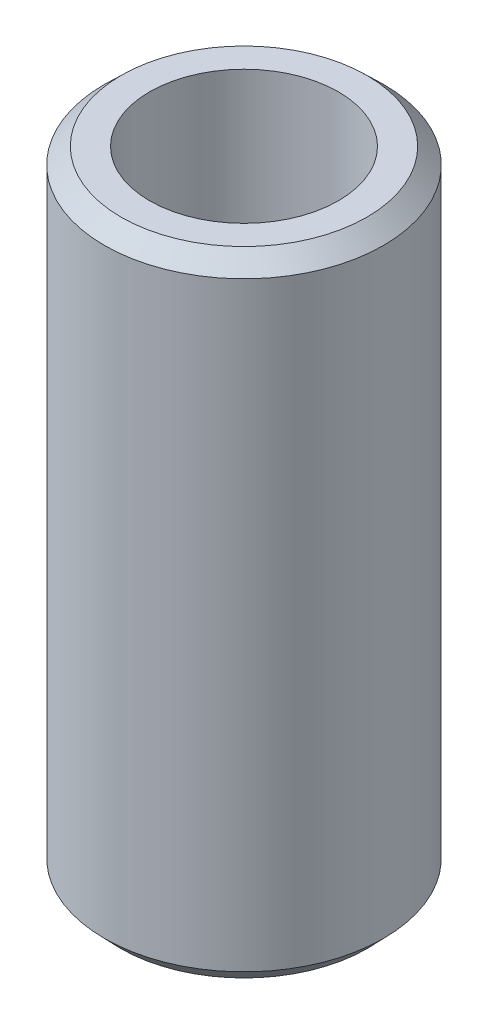
ISO-10303-21;
HEADER;
FILE_DESCRIPTION(('STEP AP214'),'2;1');
FILE_NAME('part.step','',(''),(''),'','','');
FILE_SCHEMA(('AUTOMOTIVE_DESIGN { 1 0 10303 214 1 1 1 1 }'));
ENDSEC;
DATA;
#1=APPLICATION_CONTEXT('core data for automotive mechanical design processes');
#2=APPLICATION_PROTOCOL_DEFINITION('international standard','automotive_design',2000,#1);
#3=PRODUCT_CONTEXT('',#1,'mechanical');
#4=PRODUCT('Part','Part','',(#3));
#5=PRODUCT_RELATED_PRODUCT_CATEGORY('part','',(#4));
#6=PRODUCT_DEFINITION_FORMATION('','',#4);
#7=PRODUCT_DEFINITION_CONTEXT('part definition',#1,'design');
#8=PRODUCT_DEFINITION('design','',#6,#7);
#9=PRODUCT_DEFINITION_SHAPE('','',#8);
#10=(LENGTH_UNIT() NAMED_UNIT(*) SI_UNIT(.MILLI.,.METRE.));
#11=(NAMED_UNIT(*) PLANE_ANGLE_UNIT() SI_UNIT($,.RADIAN.));
#12=(NAMED_UNIT(*) SI_UNIT($,.STERADIAN.) SOLID_ANGLE_UNIT());
#13=UNCERTAINTY_MEASURE_WITH_UNIT(LENGTH_MEASURE(1.E-05),#10,'distance_accuracy_value','');
#14=(GEOMETRIC_REPRESENTATION_CONTEXT(3) GLOBAL_UNCERTAINTY_ASSIGNED_CONTEXT((#13)) GLOBAL_UNIT_ASSIGNED_CONTEXT((#10,
#11,#12)) REPRESENTATION_CONTEXT('',''));
#15=CARTESIAN_POINT('',(0.,0.,0.));
#16=DIRECTION('',(0.,0.,1.));
#17=DIRECTION('',(1.,0.,0.));
#18=AXIS2_PLACEMENT_3D('',#15,#16,#17);
#19=CARTESIAN_POINT('',(0.,102.063704965299,0.));
#20=DIRECTION('',(0.,-1.,0.));
#21=DIRECTION('',(0.,0.,-1.));
#22=AXIS2_PLACEMENT_3D('',#19,#20,#21);
#23=CYLINDRICAL_SURFACE('',#22,22.5);
#24=CARTESIAN_POINT('',(0.,99.4673648616752,0.));
#25=DIRECTION('',(0.,1.,0.));
#26=DIRECTION('',(0.,0.,1.));
#27=AXIS2_PLACEMENT_3D('',#24,#25,#26);
#28=CIRCLE('',#27,22.5);
#29=CARTESIAN_POINT('',(0.,99.4673648616752,22.5));
#30=VERTEX_POINT('',#29);
#31=EDGE_CURVE('E50',#30,#30,#28,.F.);
#32=ORIENTED_EDGE('',*,*,#31,.T.);
#33=EDGE_LOOP('',(#32));
#34=FACE_BOUND('',#33,.T.);
#35=CARTESIAN_POINT('',(0.,2.69394294349172,0.));
#36=DIRECTION('',(0.,1.,0.));
#37=DIRECTION('',(0.,0.,1.));
#38=AXIS2_PLACEMENT_3D('',#35,#36,#37);
#39=CIRCLE('',#38,22.5);
#40=CARTESIAN_POINT('',(0.,2.69394294349172,22.5));
#41=VERTEX_POINT('',#40);
#42=EDGE_CURVE('E51',#41,#41,#39,.T.);
#43=ORIENTED_EDGE('',*,*,#42,.T.);
#44=EDGE_LOOP('',(#43));
#45=FACE_BOUND('',#44,.T.);
#46=ADVANCED_FACE('F39',(#34,#45),#23,.T.);
#47=CARTESIAN_POINT('',(0.,102.063704965299,0.));
#48=DIRECTION('',(0.,1.,0.));
#49=DIRECTION('',(0.,0.,1.));
#50=AXIS2_PLACEMENT_3D('',#47,#48,#49);
#51=PLANE('',#50);
#52=CARTESIAN_POINT('',(0.,102.063704965299,0.));
#53=DIRECTION('',(0.,1.,0.));
#54=DIRECTION('',(0.,0.,1.));
#55=AXIS2_PLACEMENT_3D('',#52,#53,#54);
#56=CIRCLE('',#55,19.8060570565083);
#57=CARTESIAN_POINT('',(0.,102.063704965299,19.8060570565083));
#58=VERTEX_POINT('',#57);
#59=EDGE_CURVE('E54',#58,#58,#56,.T.);
#60=ORIENTED_EDGE('',*,*,#59,.T.);
#61=EDGE_LOOP('',(#60));
#62=FACE_BOUND('',#61,.T.);
#63=CARTESIAN_POINT('',(0.,102.063704965299,0.));
#64=DIRECTION('',(0.,1.,0.));
#65=DIRECTION('',(0.,0.,1.));
#66=AXIS2_PLACEMENT_3D('',#63,#64,#65);
#67=CIRCLE('',#66,15.2227138544082);
#68=CARTESIAN_POINT('',(0.,102.063704965299,15.2227138544082));
#69=VERTEX_POINT('',#68);
#70=EDGE_CURVE('E58',#69,#69,#67,.T.);
#71=ORIENTED_EDGE('',*,*,#70,.F.);
#72=EDGE_LOOP('',(#71));
#73=FACE_BOUND('',#72,.T.);
#74=ADVANCED_FACE('F69',(#62,#73),#51,.T.);
#75=CARTESIAN_POINT('',(0.,0.,0.));
#76=DIRECTION('',(0.,1.,0.));
#77=DIRECTION('',(0.,0.,1.));
#78=AXIS2_PLACEMENT_3D('',#75,#76,#77);
#79=PLANE('',#78);
#80=CARTESIAN_POINT('',(0.,0.,0.));
#81=DIRECTION('',(0.,1.,0.));
#82=DIRECTION('',(0.,0.,1.));
#83=AXIS2_PLACEMENT_3D('',#80,#81,#82);
#84=CIRCLE('',#83,19.9036598963761);
#85=CARTESIAN_POINT('',(0.,0.,19.9036598963761));
#86=VERTEX_POINT('',#85);
#87=EDGE_CURVE('E10',#86,#86,#84,.F.);
#88=ORIENTED_EDGE('',*,*,#87,.T.);
#89=EDGE_LOOP('',(#88));
#90=FACE_BOUND('',#89,.T.);
#91=CARTESIAN_POINT('',(0.,0.,0.));
#92=DIRECTION('',(0.,1.,0.));
#93=DIRECTION('',(0.,0.,1.));
#94=AXIS2_PLACEMENT_3D('',#91,#92,#93);
#95=CIRCLE('',#94,15.2227138544082);
#96=CARTESIAN_POINT('',(0.,0.,15.2227138544082));
#97=VERTEX_POINT('',#96);
#98=EDGE_CURVE('E63',#97,#97,#95,.T.);
#99=ORIENTED_EDGE('',*,*,#98,.T.);
#100=EDGE_LOOP('',(#99));
#101=FACE_BOUND('',#100,.T.);
#102=ADVANCED_FACE('F75',(#90,#101),#79,.F.);
#103=CARTESIAN_POINT('',(0.,102.063704965299,0.));
#104=DIRECTION('',(0.,-1.,0.));
#105=DIRECTION('',(0.,0.,-1.));
#106=AXIS2_PLACEMENT_3D('',#103,#104,#105);
#107=CYLINDRICAL_SURFACE('',#106,15.2227138544082);
#108=ORIENTED_EDGE('',*,*,#70,.T.);
#109=EDGE_LOOP('',(#108));
#110=FACE_BOUND('',#109,.T.);
#111=ORIENTED_EDGE('',*,*,#98,.F.);
#112=EDGE_LOOP('',(#111));
#113=FACE_BOUND('',#112,.T.);
#114=ADVANCED_FACE('F70',(#110,#113),#107,.F.);
#115=CARTESIAN_POINT('',(0.,102.063704965299,0.));
#116=DIRECTION('',(0.,-1.,0.));
#117=DIRECTION('',(0.,0.,-1.));
#118=AXIS2_PLACEMENT_3D('',#115,#116,#117);
#119=CONICAL_SURFACE('',#118,19.8060570565083,0.803845525696142);
#120=ORIENTED_EDGE('',*,*,#31,.F.);
#121=EDGE_LOOP('',(#120));
#122=FACE_BOUND('',#121,.T.);
#123=ORIENTED_EDGE('',*,*,#59,.F.);
#124=EDGE_LOOP('',(#123));
#125=FACE_BOUND('',#124,.T.);
#126=ADVANCED_FACE('F81',(#122,#125),#119,.T.);
#127=CARTESIAN_POINT('',(0.,2.69394294349172,0.));
#128=DIRECTION('',(0.,1.,0.));
#129=DIRECTION('',(0.,0.,1.));
#130=AXIS2_PLACEMENT_3D('',#127,#128,#129);
#131=CONICAL_SURFACE('',#130,22.5,0.766950801098751);
#132=ORIENTED_EDGE('',*,*,#87,.F.);
#133=EDGE_LOOP('',(#132));
#134=FACE_BOUND('',#133,.T.);
#135=ORIENTED_EDGE('',*,*,#42,.F.);
#136=EDGE_LOOP('',(#135));
#137=FACE_BOUND('',#136,.T.);
#138=ADVANCED_FACE('F45',(#134,#137),#131,.T.);
#139=CLOSED_SHELL('',(#46,#74,#102,#114,#126,#138));
#140=MANIFOLD_SOLID_BREP('B2',#139);
#141=ADVANCED_BREP_SHAPE_REPRESENTATION('',(#18,#140),#14);
#142=SHAPE_DEFINITION_REPRESENTATION(#9,#141);
ENDSEC;
END-ISO-10303-21;
